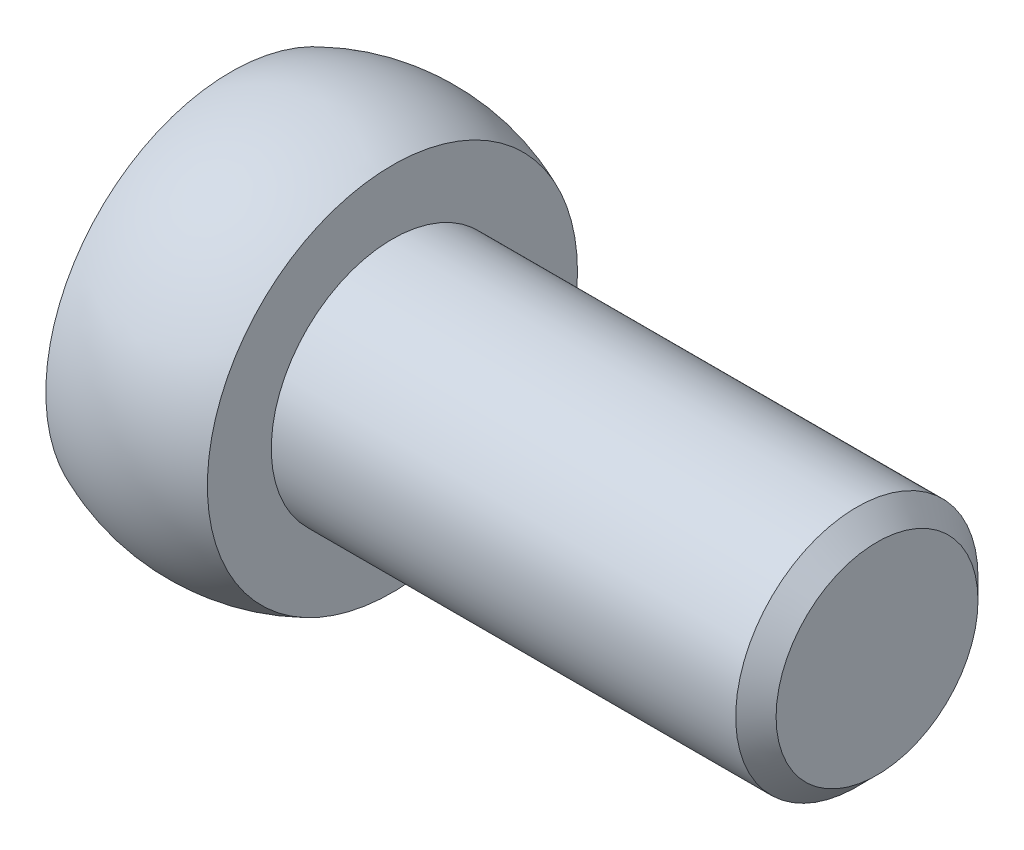
ISO-10303-21;
HEADER;
FILE_DESCRIPTION(('STEP AP214'),'2;1');
FILE_NAME('part.step','',(''),(''),'','','');
FILE_SCHEMA(('AUTOMOTIVE_DESIGN { 1 0 10303 214 1 1 1 1 }'));
ENDSEC;
DATA;
#1=APPLICATION_CONTEXT('core data for automotive mechanical design processes');
#2=APPLICATION_PROTOCOL_DEFINITION('international standard','automotive_design',2000,#1);
#3=PRODUCT_CONTEXT('',#1,'mechanical');
#4=PRODUCT('Part','Part','',(#3));
#5=PRODUCT_RELATED_PRODUCT_CATEGORY('part','',(#4));
#6=PRODUCT_DEFINITION_FORMATION('','',#4);
#7=PRODUCT_DEFINITION_CONTEXT('part definition',#1,'design');
#8=PRODUCT_DEFINITION('design','',#6,#7);
#9=PRODUCT_DEFINITION_SHAPE('','',#8);
#10=(LENGTH_UNIT() NAMED_UNIT(*) SI_UNIT(.MILLI.,.METRE.));
#11=(NAMED_UNIT(*) PLANE_ANGLE_UNIT() SI_UNIT($,.RADIAN.));
#12=(NAMED_UNIT(*) SI_UNIT($,.STERADIAN.) SOLID_ANGLE_UNIT());
#13=UNCERTAINTY_MEASURE_WITH_UNIT(LENGTH_MEASURE(1.E-05),#10,'distance_accuracy_value','');
#14=(GEOMETRIC_REPRESENTATION_CONTEXT(3) GLOBAL_UNCERTAINTY_ASSIGNED_CONTEXT((#13)) GLOBAL_UNIT_ASSIGNED_CONTEXT((#10,
#11,#12)) REPRESENTATION_CONTEXT('',''));
#15=CARTESIAN_POINT('',(0.,0.,0.));
#16=DIRECTION('',(0.,0.,1.));
#17=DIRECTION('',(1.,0.,0.));
#18=AXIS2_PLACEMENT_3D('',#15,#16,#17);
#19=CARTESIAN_POINT('',(0.,0.,0.));
#20=DIRECTION('',(-1.,0.,0.));
#21=DIRECTION('',(0.,0.,1.));
#22=AXIS2_PLACEMENT_3D('',#19,#20,#21);
#23=PLANE('',#22);
#24=CARTESIAN_POINT('',(0.,0.,0.));
#25=DIRECTION('',(1.,0.,0.));
#26=DIRECTION('',(0.,0.,-1.));
#27=AXIS2_PLACEMENT_3D('',#24,#25,#26);
#28=CIRCLE('',#27,4.58257569495584);
#29=CARTESIAN_POINT('',(0.,0.,-4.58257569495584));
#30=VERTEX_POINT('',#29);
#31=EDGE_CURVE('E10',#30,#30,#28,.T.);
#32=ORIENTED_EDGE('',*,*,#31,.F.);
#33=EDGE_LOOP('',(#32));
#34=FACE_BOUND('',#33,.T.);
#35=ADVANCED_FACE('F29',(#34),#23,.T.);
#36=CARTESIAN_POINT('',(2.,0.,0.));
#37=DIRECTION('',(1.,0.,0.));
#38=DIRECTION('',(0.,1.,0.));
#39=AXIS2_PLACEMENT_3D('',#36,#37,#38);
#40=SPHERICAL_SURFACE('',#39,5.);
#41=ORIENTED_EDGE('',*,*,#31,.T.);
#42=EDGE_LOOP('',(#41));
#43=FACE_BOUND('',#42,.T.);
#44=CARTESIAN_POINT('',(4.,0.,0.));
#45=DIRECTION('',(1.,0.,0.));
#46=DIRECTION('',(0.,0.,-1.));
#47=AXIS2_PLACEMENT_3D('',#44,#45,#46);
#48=CIRCLE('',#47,4.58257569495584);
#49=CARTESIAN_POINT('',(4.,0.,-4.58257569495584));
#50=VERTEX_POINT('',#49);
#51=EDGE_CURVE('E35',#50,#50,#48,.T.);
#52=ORIENTED_EDGE('',*,*,#51,.F.);
#53=EDGE_LOOP('',(#52));
#54=FACE_BOUND('',#53,.T.);
#55=ADVANCED_FACE('F68',(#43,#54),#40,.T.);
#56=CARTESIAN_POINT('',(4.,4.58257569495584,0.));
#57=DIRECTION('',(1.,0.,0.));
#58=DIRECTION('',(0.,0.,-1.));
#59=AXIS2_PLACEMENT_3D('',#56,#57,#58);
#60=PLANE('',#59);
#61=ORIENTED_EDGE('',*,*,#51,.T.);
#62=EDGE_LOOP('',(#61));
#63=FACE_BOUND('',#62,.T.);
#64=CARTESIAN_POINT('',(4.,0.,0.));
#65=DIRECTION('',(1.,0.,0.));
#66=DIRECTION('',(0.,0.,-1.));
#67=AXIS2_PLACEMENT_3D('',#64,#65,#66);
#68=CIRCLE('',#67,3.);
#69=CARTESIAN_POINT('',(4.,0.,-3.));
#70=VERTEX_POINT('',#69);
#71=EDGE_CURVE('E39',#70,#70,#68,.T.);
#72=ORIENTED_EDGE('',*,*,#71,.F.);
#73=EDGE_LOOP('',(#72));
#74=FACE_BOUND('',#73,.T.);
#75=ADVANCED_FACE('F64',(#63,#74),#60,.T.);
#76=CARTESIAN_POINT('',(0.,0.,0.));
#77=DIRECTION('',(1.,0.,0.));
#78=DIRECTION('',(0.,0.,-1.));
#79=AXIS2_PLACEMENT_3D('',#76,#77,#78);
#80=CYLINDRICAL_SURFACE('',#79,3.);
#81=ORIENTED_EDGE('',*,*,#71,.T.);
#82=EDGE_LOOP('',(#81));
#83=FACE_BOUND('',#82,.T.);
#84=CARTESIAN_POINT('',(15.5,0.,0.));
#85=DIRECTION('',(1.,0.,0.));
#86=DIRECTION('',(0.,0.,-1.));
#87=AXIS2_PLACEMENT_3D('',#84,#85,#86);
#88=CIRCLE('',#87,3.);
#89=CARTESIAN_POINT('',(15.5,0.,-3.));
#90=VERTEX_POINT('',#89);
#91=EDGE_CURVE('E43',#90,#90,#88,.T.);
#92=ORIENTED_EDGE('',*,*,#91,.F.);
#93=EDGE_LOOP('',(#92));
#94=FACE_BOUND('',#93,.T.);
#95=ADVANCED_FACE('F56',(#83,#94),#80,.T.);
#96=CARTESIAN_POINT('',(16.,0.,0.));
#97=DIRECTION('',(-1.,0.,0.));
#98=DIRECTION('',(0.,0.,1.));
#99=AXIS2_PLACEMENT_3D('',#96,#97,#98);
#100=CONICAL_SURFACE('',#99,2.5,0.785398163397446);
#101=ORIENTED_EDGE('',*,*,#91,.T.);
#102=EDGE_LOOP('',(#101));
#103=FACE_BOUND('',#102,.T.);
#104=CARTESIAN_POINT('',(16.,0.,0.));
#105=DIRECTION('',(1.,0.,0.));
#106=DIRECTION('',(0.,0.,-1.));
#107=AXIS2_PLACEMENT_3D('',#104,#105,#106);
#108=CIRCLE('',#107,2.5);
#109=CARTESIAN_POINT('',(16.,0.,-2.5));
#110=VERTEX_POINT('',#109);
#111=EDGE_CURVE('E48',#110,#110,#108,.T.);
#112=ORIENTED_EDGE('',*,*,#111,.F.);
#113=EDGE_LOOP('',(#112));
#114=FACE_BOUND('',#113,.T.);
#115=ADVANCED_FACE('F54',(#103,#114),#100,.T.);
#116=CARTESIAN_POINT('',(16.,2.5,0.));
#117=DIRECTION('',(1.,0.,0.));
#118=DIRECTION('',(0.,0.,-1.));
#119=AXIS2_PLACEMENT_3D('',#116,#117,#118);
#120=PLANE('',#119);
#121=ORIENTED_EDGE('',*,*,#111,.T.);
#122=EDGE_LOOP('',(#121));
#123=FACE_BOUND('',#122,.T.);
#124=ADVANCED_FACE('F52',(#123),#120,.T.);
#125=CLOSED_SHELL('',(#35,#55,#75,#95,#115,#124));
#126=MANIFOLD_SOLID_BREP('B2',#125);
#127=ADVANCED_BREP_SHAPE_REPRESENTATION('',(#18,#126),#14);
#128=SHAPE_DEFINITION_REPRESENTATION(#9,#127);
ENDSEC;
END-ISO-10303-21;
